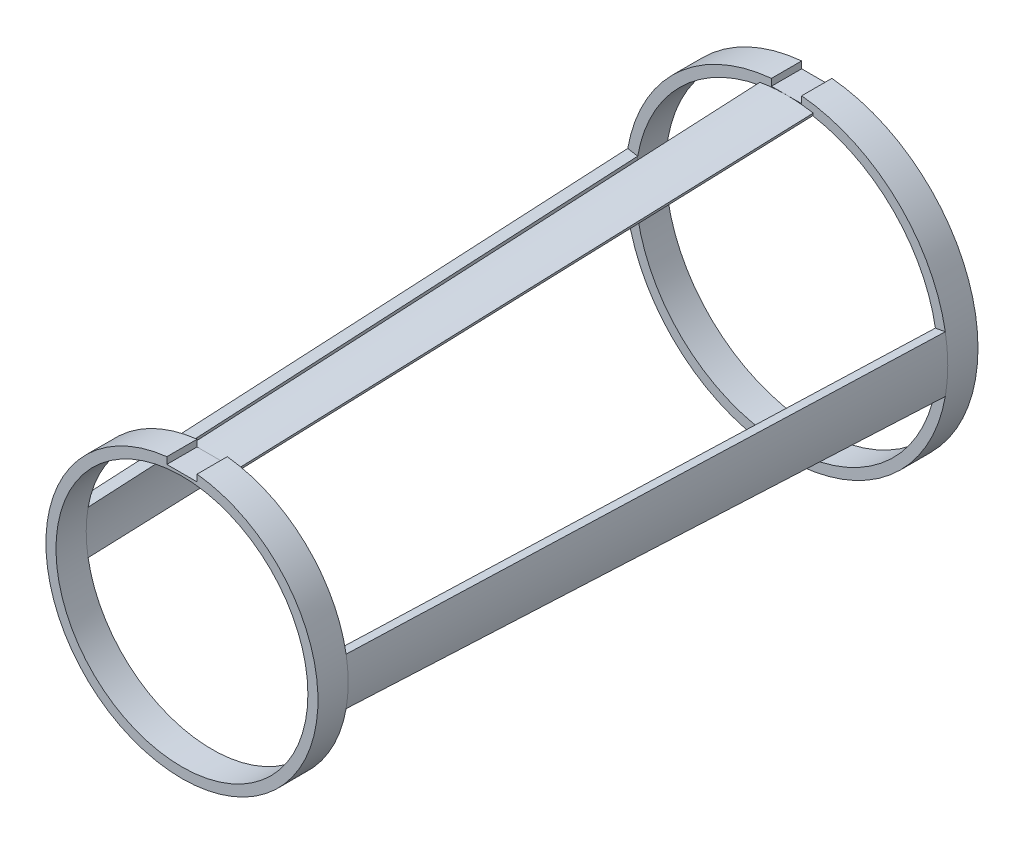
ISO-10303-21;
HEADER;
FILE_DESCRIPTION(('STEP AP214'),'2;1');
FILE_NAME('part.step','',(''),(''),'','','');
FILE_SCHEMA(('AUTOMOTIVE_DESIGN { 1 0 10303 214 1 1 1 1 }'));
ENDSEC;
DATA;
#1=APPLICATION_CONTEXT('core data for automotive mechanical design processes');
#2=APPLICATION_PROTOCOL_DEFINITION('international standard','automotive_design',2000,#1);
#3=PRODUCT_CONTEXT('',#1,'mechanical');
#4=PRODUCT('Part','Part','',(#3));
#5=PRODUCT_RELATED_PRODUCT_CATEGORY('part','',(#4));
#6=PRODUCT_DEFINITION_FORMATION('','',#4);
#7=PRODUCT_DEFINITION_CONTEXT('part definition',#1,'design');
#8=PRODUCT_DEFINITION('design','',#6,#7);
#9=PRODUCT_DEFINITION_SHAPE('','',#8);
#10=(LENGTH_UNIT() NAMED_UNIT(*) SI_UNIT(.MILLI.,.METRE.));
#11=(NAMED_UNIT(*) PLANE_ANGLE_UNIT() SI_UNIT($,.RADIAN.));
#12=(NAMED_UNIT(*) SI_UNIT($,.STERADIAN.) SOLID_ANGLE_UNIT());
#13=UNCERTAINTY_MEASURE_WITH_UNIT(LENGTH_MEASURE(1.E-05),#10,'distance_accuracy_value','');
#14=(GEOMETRIC_REPRESENTATION_CONTEXT(3) GLOBAL_UNCERTAINTY_ASSIGNED_CONTEXT((#13)) GLOBAL_UNIT_ASSIGNED_CONTEXT((#10,
#11,#12)) REPRESENTATION_CONTEXT('',''));
#15=CARTESIAN_POINT('',(0.,0.,0.));
#16=DIRECTION('',(0.,0.,1.));
#17=DIRECTION('',(1.,0.,0.));
#18=AXIS2_PLACEMENT_3D('',#15,#16,#17);
#19=CARTESIAN_POINT('',(0.,0.,3.81));
#20=DIRECTION('',(0.,0.,1.));
#21=DIRECTION('',(1.,0.,0.));
#22=AXIS2_PLACEMENT_3D('',#19,#20,#21);
#23=PLANE('',#22);
#24=CARTESIAN_POINT('',(0.,0.,3.81));
#25=DIRECTION('',(0.,0.,1.));
#26=DIRECTION('',(1.,0.,0.));
#27=AXIS2_PLACEMENT_3D('',#24,#25,#26);
#28=CIRCLE('',#27,38.1);
#29=CARTESIAN_POINT('',(-6.61599556911006,37.5211753897651,3.81));
#30=VERTEX_POINT('',#29);
#31=CARTESIAN_POINT('',(-37.5211753897651,6.61599556911006,3.81));
#32=VERTEX_POINT('',#31);
#33=EDGE_CURVE('E230',#30,#32,#28,.T.);
#34=ORIENTED_EDGE('',*,*,#33,.F.);
#35=DIRECTION('',(-0.173648177666931,0.984807753012208,0.));
#36=VECTOR('',#35,1.);
#37=CARTESIAN_POINT('',(-6.72626216192856,38.1465283129279,3.81));
#38=LINE('',#37,#36);
#39=CARTESIAN_POINT('',(-6.72626216192856,38.1465283129279,3.81));
#40=VERTEX_POINT('',#39);
#41=EDGE_CURVE('E57',#30,#40,#38,.T.);
#42=ORIENTED_EDGE('',*,*,#41,.T.);
#43=CARTESIAN_POINT('',(0.,0.,3.81));
#44=DIRECTION('',(0.,0.,-1.));
#45=DIRECTION('',(0.,1.,0.));
#46=AXIS2_PLACEMENT_3D('',#43,#44,#45);
#47=CIRCLE('',#46,38.735);
#48=CARTESIAN_POINT('',(-1.70648220900196E-11,38.735,3.81));
#49=VERTEX_POINT('',#48);
#50=EDGE_CURVE('E199',#40,#49,#47,.T.);
#51=ORIENTED_EDGE('',*,*,#50,.T.);
#52=DIRECTION('',(1.,0.,0.));
#53=VECTOR('',#52,1.);
#54=CARTESIAN_POINT('',(-3.81,38.735,3.81));
#55=LINE('',#54,#53);
#56=CARTESIAN_POINT('',(-3.81,38.735,3.81));
#57=VERTEX_POINT('',#56);
#58=EDGE_CURVE('E239',#57,#49,#55,.T.);
#59=ORIENTED_EDGE('',*,*,#58,.F.);
#60=DIRECTION('',(0.,-1.,0.));
#61=VECTOR('',#60,1.);
#62=CARTESIAN_POINT('',(-3.81,38.735,3.81));
#63=LINE('',#62,#61);
#64=CARTESIAN_POINT('',(-3.81,40.4610120980679,3.81));
#65=VERTEX_POINT('',#64);
#66=EDGE_CURVE('E265',#65,#57,#63,.T.);
#67=ORIENTED_EDGE('',*,*,#66,.F.);
#68=CARTESIAN_POINT('',(0.,0.,3.81));
#69=DIRECTION('',(0.,0.,1.));
#70=DIRECTION('',(1.,0.,0.));
#71=AXIS2_PLACEMENT_3D('',#68,#69,#70);
#72=CIRCLE('',#71,40.64);
#73=CARTESIAN_POINT('',(-40.0225870824161,7.05706194038406,3.81));
#74=VERTEX_POINT('',#73);
#75=EDGE_CURVE('E11',#65,#74,#72,.T.);
#76=ORIENTED_EDGE('',*,*,#75,.T.);
#77=DIRECTION('',(-0.984807753012208,0.173648177666931,0.));
#78=VECTOR('',#77,1.);
#79=CARTESIAN_POINT('',(-40.0225870824161,7.05706194038406,3.81));
#80=LINE('',#79,#78);
#81=EDGE_CURVE('E324',#32,#74,#80,.T.);
#82=ORIENTED_EDGE('',*,*,#81,.F.);
#83=EDGE_LOOP('',(#34,#42,#51,#59,#67,#76,#82));
#84=FACE_BOUND('',#83,.T.);
#85=ADVANCED_FACE('F39',(#84),#23,.T.);
#86=CARTESIAN_POINT('',(0.,0.,148.59));
#87=DIRECTION('',(0.,0.,1.));
#88=DIRECTION('',(1.,0.,0.));
#89=AXIS2_PLACEMENT_3D('',#86,#87,#88);
#90=PLANE('',#89);
#91=DIRECTION('',(0.173648177666931,-0.984807753012208,0.));
#92=VECTOR('',#91,1.);
#93=CARTESIAN_POINT('',(-5.62359623374355,31.8929990813004,148.59));
#94=LINE('',#93,#92);
#95=CARTESIAN_POINT('',(-5.62359623374355,31.8929990813004,148.59));
#96=VERTEX_POINT('',#95);
#97=CARTESIAN_POINT('',(-5.51332964092505,31.2676461581376,148.59));
#98=VERTEX_POINT('',#97);
#99=EDGE_CURVE('E442',#96,#98,#94,.T.);
#100=ORIENTED_EDGE('',*,*,#99,.T.);
#101=CARTESIAN_POINT('',(0.,0.,148.59));
#102=DIRECTION('',(0.,0.,1.));
#103=DIRECTION('',(1.,0.,0.));
#104=AXIS2_PLACEMENT_3D('',#101,#102,#103);
#105=CIRCLE('',#104,31.75);
#106=CARTESIAN_POINT('',(-31.2676461581376,5.51332964092505,148.59));
#107=VERTEX_POINT('',#106);
#108=EDGE_CURVE('E344',#98,#107,#105,.T.);
#109=ORIENTED_EDGE('',*,*,#108,.T.);
#110=DIRECTION('',(0.984807753012208,-0.173648177666931,0.));
#111=VECTOR('',#110,1.);
#112=CARTESIAN_POINT('',(-33.7690578507886,5.95439601219906,148.59));
#113=LINE('',#112,#111);
#114=CARTESIAN_POINT('',(-33.7690578507886,5.95439601219906,148.59));
#115=VERTEX_POINT('',#114);
#116=EDGE_CURVE('E316',#115,#107,#113,.T.);
#117=ORIENTED_EDGE('',*,*,#116,.F.);
#118=CARTESIAN_POINT('',(0.,0.,148.59));
#119=DIRECTION('',(0.,0.,1.));
#120=DIRECTION('',(1.,0.,0.));
#121=AXIS2_PLACEMENT_3D('',#118,#119,#120);
#122=CIRCLE('',#121,34.29);
#123=CARTESIAN_POINT('',(-3.81,34.0776759770968,148.59));
#124=VERTEX_POINT('',#123);
#125=EDGE_CURVE('E334',#124,#115,#122,.T.);
#126=ORIENTED_EDGE('',*,*,#125,.F.);
#127=DIRECTION('',(0.,1.,0.));
#128=VECTOR('',#127,1.);
#129=CARTESIAN_POINT('',(-3.81,32.385,148.59));
#130=LINE('',#129,#128);
#131=CARTESIAN_POINT('',(-3.81,32.385,148.59));
#132=VERTEX_POINT('',#131);
#133=EDGE_CURVE('E392',#132,#124,#130,.T.);
#134=ORIENTED_EDGE('',*,*,#133,.F.);
#135=DIRECTION('',(-1.,0.,0.));
#136=VECTOR('',#135,1.);
#137=CARTESIAN_POINT('',(-3.81,32.385,148.59));
#138=LINE('',#137,#136);
#139=CARTESIAN_POINT('',(-1.0468622496651E-11,32.385,148.59));
#140=VERTEX_POINT('',#139);
#141=EDGE_CURVE('E419',#140,#132,#138,.T.);
#142=ORIENTED_EDGE('',*,*,#141,.F.);
#143=CARTESIAN_POINT('',(0.,0.,148.59));
#144=DIRECTION('',(0.,0.,-1.));
#145=DIRECTION('',(0.,1.,0.));
#146=AXIS2_PLACEMENT_3D('',#143,#144,#145);
#147=CIRCLE('',#146,32.385);
#148=EDGE_CURVE('E65',#96,#140,#147,.T.);
#149=ORIENTED_EDGE('',*,*,#148,.F.);
#150=EDGE_LOOP('',(#100,#109,#117,#126,#134,#142,#149));
#151=FACE_BOUND('',#150,.T.);
#152=ADVANCED_FACE('F487',(#151),#90,.F.);
#153=CARTESIAN_POINT('',(-40.0225870824161,-7.05706194038406,3.81));
#154=VERTEX_POINT('',#153);
#155=CARTESIAN_POINT('',(40.0225870824161,-7.05706194038406,3.81));
#156=VERTEX_POINT('',#155);
#157=EDGE_CURVE('E49',#154,#156,#72,.T.);
#158=ORIENTED_EDGE('',*,*,#157,.T.);
#159=DIRECTION('',(-0.984807753012208,0.173648177666931,0.));
#160=VECTOR('',#159,1.);
#161=CARTESIAN_POINT('',(40.0225870824161,-7.05706194038406,3.81));
#162=LINE('',#161,#160);
#163=CARTESIAN_POINT('',(37.5211753897651,-6.61599556911006,3.81));
#164=VERTEX_POINT('',#163);
#165=EDGE_CURVE('E388',#156,#164,#162,.T.);
#166=ORIENTED_EDGE('',*,*,#165,.T.);
#167=CARTESIAN_POINT('',(-37.5211753897651,-6.61599556911006,3.81));
#168=VERTEX_POINT('',#167);
#169=EDGE_CURVE('E229',#168,#164,#28,.T.);
#170=ORIENTED_EDGE('',*,*,#169,.F.);
#171=DIRECTION('',(-0.984807753012208,-0.173648177666931,0.));
#172=VECTOR('',#171,1.);
#173=CARTESIAN_POINT('',(-40.0225870824161,-7.05706194038406,3.81));
#174=LINE('',#173,#172);
#175=EDGE_CURVE('E309',#168,#154,#174,.T.);
#176=ORIENTED_EDGE('',*,*,#175,.T.);
#177=EDGE_LOOP('',(#158,#166,#170,#176));
#178=FACE_BOUND('',#177,.T.);
#179=ADVANCED_FACE('F509',(#178),#23,.T.);
#180=DIRECTION('',(0.984807753012208,-0.173648177666931,0.));
#181=VECTOR('',#180,1.);
#182=CARTESIAN_POINT('',(33.7690578507886,-5.95439601219906,148.59));
#183=LINE('',#182,#181);
#184=CARTESIAN_POINT('',(31.2676461581376,-5.51332964092505,148.59));
#185=VERTEX_POINT('',#184);
#186=CARTESIAN_POINT('',(33.7690578507886,-5.95439601219906,148.59));
#187=VERTEX_POINT('',#186);
#188=EDGE_CURVE('E381',#185,#187,#183,.T.);
#189=ORIENTED_EDGE('',*,*,#188,.T.);
#190=CARTESIAN_POINT('',(-33.7690578507886,-5.95439601219905,148.59));
#191=VERTEX_POINT('',#190);
#192=EDGE_CURVE('E329',#191,#187,#122,.T.);
#193=ORIENTED_EDGE('',*,*,#192,.F.);
#194=DIRECTION('',(0.984807753012208,0.173648177666931,0.));
#195=VECTOR('',#194,1.);
#196=CARTESIAN_POINT('',(-33.7690578507886,-5.95439601219905,148.59));
#197=LINE('',#196,#195);
#198=CARTESIAN_POINT('',(-31.2676461581376,-5.51332964092505,148.59));
#199=VERTEX_POINT('',#198);
#200=EDGE_CURVE('E302',#191,#199,#197,.T.);
#201=ORIENTED_EDGE('',*,*,#200,.T.);
#202=EDGE_CURVE('E338',#199,#185,#105,.T.);
#203=ORIENTED_EDGE('',*,*,#202,.T.);
#204=EDGE_LOOP('',(#189,#193,#201,#203));
#205=FACE_BOUND('',#204,.T.);
#206=ADVANCED_FACE('F557',(#205),#90,.F.);
#207=CARTESIAN_POINT('',(6.72626216192856,38.1465283129279,3.81));
#208=VERTEX_POINT('',#207);
#209=EDGE_CURVE('E219',#49,#208,#47,.T.);
#210=ORIENTED_EDGE('',*,*,#209,.T.);
#211=DIRECTION('',(0.173648177666931,0.984807753012208,0.));
#212=VECTOR('',#211,1.);
#213=CARTESIAN_POINT('',(6.72626216192856,38.1465283129279,3.81));
#214=LINE('',#213,#212);
#215=CARTESIAN_POINT('',(6.61599556911006,37.5211753897651,3.81));
#216=VERTEX_POINT('',#215);
#217=EDGE_CURVE('E206',#216,#208,#214,.T.);
#218=ORIENTED_EDGE('',*,*,#217,.F.);
#219=CARTESIAN_POINT('',(37.5211753897651,6.61599556911006,3.81));
#220=VERTEX_POINT('',#219);
#221=EDGE_CURVE('E216',#220,#216,#28,.T.);
#222=ORIENTED_EDGE('',*,*,#221,.F.);
#223=DIRECTION('',(-0.984807753012208,-0.173648177666931,0.));
#224=VECTOR('',#223,1.);
#225=CARTESIAN_POINT('',(40.0225870824161,7.05706194038406,3.81));
#226=LINE('',#225,#224);
#227=CARTESIAN_POINT('',(40.0225870824161,7.05706194038406,3.81));
#228=VERTEX_POINT('',#227);
#229=EDGE_CURVE('E373',#228,#220,#226,.T.);
#230=ORIENTED_EDGE('',*,*,#229,.F.);
#231=CARTESIAN_POINT('',(3.81,40.4610120980679,3.81));
#232=VERTEX_POINT('',#231);
#233=EDGE_CURVE('E50',#228,#232,#72,.T.);
#234=ORIENTED_EDGE('',*,*,#233,.T.);
#235=DIRECTION('',(0.,1.,0.));
#236=VECTOR('',#235,1.);
#237=CARTESIAN_POINT('',(3.81,38.735,3.81));
#238=LINE('',#237,#236);
#239=CARTESIAN_POINT('',(3.81,38.735,3.81));
#240=VERTEX_POINT('',#239);
#241=EDGE_CURVE('E259',#240,#232,#238,.T.);
#242=ORIENTED_EDGE('',*,*,#241,.F.);
#243=EDGE_CURVE('E247',#49,#240,#55,.T.);
#244=ORIENTED_EDGE('',*,*,#243,.F.);
#245=EDGE_LOOP('',(#210,#218,#222,#230,#234,#242,#244));
#246=FACE_BOUND('',#245,.T.);
#247=ADVANCED_FACE('F214',(#246),#23,.T.);
#248=CARTESIAN_POINT('',(0.,0.,-3.81));
#249=DIRECTION('',(0.,0.,1.));
#250=DIRECTION('',(1.,0.,0.));
#251=AXIS2_PLACEMENT_3D('',#248,#249,#250);
#252=PLANE('',#251);
#253=CARTESIAN_POINT('',(0.,0.,-3.81));
#254=DIRECTION('',(0.,0.,1.));
#255=DIRECTION('',(1.,0.,0.));
#256=AXIS2_PLACEMENT_3D('',#253,#254,#255);
#257=CIRCLE('',#256,38.1);
#258=CARTESIAN_POINT('',(38.1,0.,-3.81));
#259=VERTEX_POINT('',#258);
#260=EDGE_CURVE('E235',#259,#259,#257,.T.);
#261=ORIENTED_EDGE('',*,*,#260,.T.);
#262=EDGE_LOOP('',(#261));
#263=FACE_BOUND('',#262,.T.);
#264=DIRECTION('',(0.,-1.,0.));
#265=VECTOR('',#264,1.);
#266=CARTESIAN_POINT('',(3.81,38.735,-3.81));
#267=LINE('',#266,#265);
#268=CARTESIAN_POINT('',(3.81,40.4610120980679,-3.81));
#269=VERTEX_POINT('',#268);
#270=CARTESIAN_POINT('',(3.81,38.735,-3.81));
#271=VERTEX_POINT('',#270);
#272=EDGE_CURVE('E279',#269,#271,#267,.T.);
#273=ORIENTED_EDGE('',*,*,#272,.F.);
#274=CARTESIAN_POINT('',(0.,0.,-3.81));
#275=DIRECTION('',(0.,0.,1.));
#276=DIRECTION('',(1.,0.,0.));
#277=AXIS2_PLACEMENT_3D('',#274,#275,#276);
#278=CIRCLE('',#277,40.64);
#279=CARTESIAN_POINT('',(-3.81,40.4610120980679,-3.81));
#280=VERTEX_POINT('',#279);
#281=EDGE_CURVE('E43',#280,#269,#278,.T.);
#282=ORIENTED_EDGE('',*,*,#281,.F.);
#283=DIRECTION('',(0.,1.,0.));
#284=VECTOR('',#283,1.);
#285=CARTESIAN_POINT('',(-3.81,38.735,-3.81));
#286=LINE('',#285,#284);
#287=CARTESIAN_POINT('',(-3.81,38.735,-3.81));
#288=VERTEX_POINT('',#287);
#289=EDGE_CURVE('E276',#288,#280,#286,.T.);
#290=ORIENTED_EDGE('',*,*,#289,.F.);
#291=DIRECTION('',(-1.,0.,0.));
#292=VECTOR('',#291,1.);
#293=CARTESIAN_POINT('',(-3.81,38.735,-3.81));
#294=LINE('',#293,#292);
#295=EDGE_CURVE('E283',#271,#288,#294,.T.);
#296=ORIENTED_EDGE('',*,*,#295,.F.);
#297=EDGE_LOOP('',(#273,#282,#290,#296));
#298=FACE_BOUND('',#297,.T.);
#299=ADVANCED_FACE('F530',(#263,#298),#252,.F.);
#300=CARTESIAN_POINT('',(0.,0.,3.81));
#301=DIRECTION('',(0.,0.,-1.));
#302=DIRECTION('',(-1.,0.,0.));
#303=AXIS2_PLACEMENT_3D('',#300,#301,#302);
#304=CYLINDRICAL_SURFACE('',#303,40.64);
#305=DIRECTION('',(0.,0.,-1.));
#306=VECTOR('',#305,1.);
#307=CARTESIAN_POINT('',(3.81,40.4610120980679,3.81));
#308=LINE('',#307,#306);
#309=EDGE_CURVE('E268',#269,#232,#308,.F.);
#310=ORIENTED_EDGE('',*,*,#309,.T.);
#311=ORIENTED_EDGE('',*,*,#233,.F.);
#312=CARTESIAN_POINT('',(0.,0.,3.81));
#313=DIRECTION('',(0.,0.,-1.));
#314=DIRECTION('',(-1.,0.,0.));
#315=AXIS2_PLACEMENT_3D('',#312,#313,#314);
#316=CIRCLE('',#315,40.64);
#317=EDGE_CURVE('E357',#228,#156,#316,.T.);
#318=ORIENTED_EDGE('',*,*,#317,.T.);
#319=ORIENTED_EDGE('',*,*,#157,.F.);
#320=CARTESIAN_POINT('',(0.,0.,3.81));
#321=DIRECTION('',(0.,0.,-1.));
#322=DIRECTION('',(-1.,0.,0.));
#323=AXIS2_PLACEMENT_3D('',#320,#321,#322);
#324=CIRCLE('',#323,40.64);
#325=EDGE_CURVE('E294',#154,#74,#324,.T.);
#326=ORIENTED_EDGE('',*,*,#325,.T.);
#327=ORIENTED_EDGE('',*,*,#75,.F.);
#328=DIRECTION('',(0.,0.,-1.));
#329=VECTOR('',#328,1.);
#330=CARTESIAN_POINT('',(-3.81,40.4610120980679,3.81));
#331=LINE('',#330,#329);
#332=EDGE_CURVE('E272',#65,#280,#331,.T.);
#333=ORIENTED_EDGE('',*,*,#332,.T.);
#334=ORIENTED_EDGE('',*,*,#281,.T.);
#335=EDGE_LOOP('',(#310,#311,#318,#319,#326,#327,#333,#334));
#336=FACE_BOUND('',#335,.T.);
#337=ADVANCED_FACE('F41',(#336),#304,.T.);
#338=CARTESIAN_POINT('',(0.,0.,3.81));
#339=DIRECTION('',(0.,0.,-1.));
#340=DIRECTION('',(-1.,0.,0.));
#341=AXIS2_PLACEMENT_3D('',#338,#339,#340);
#342=CYLINDRICAL_SURFACE('',#341,38.1);
#343=EDGE_CURVE('E234',#32,#168,#28,.T.);
#344=ORIENTED_EDGE('',*,*,#343,.T.);
#345=ORIENTED_EDGE('',*,*,#169,.T.);
#346=CARTESIAN_POINT('',(0.,0.,3.81));
#347=DIRECTION('',(0.,0.,-1.));
#348=DIRECTION('',(-1.,0.,0.));
#349=AXIS2_PLACEMENT_3D('',#346,#347,#348);
#350=CIRCLE('',#349,38.1);
#351=EDGE_CURVE('E227',#220,#164,#350,.T.);
#352=ORIENTED_EDGE('',*,*,#351,.F.);
#353=ORIENTED_EDGE('',*,*,#221,.T.);
#354=CARTESIAN_POINT('',(0.,0.,3.81));
#355=DIRECTION('',(0.,0.,-1.));
#356=DIRECTION('',(0.,1.,0.));
#357=AXIS2_PLACEMENT_3D('',#354,#355,#356);
#358=CIRCLE('',#357,38.1);
#359=EDGE_CURVE('E188',#30,#216,#358,.T.);
#360=ORIENTED_EDGE('',*,*,#359,.F.);
#361=ORIENTED_EDGE('',*,*,#33,.T.);
#362=EDGE_LOOP('',(#344,#345,#352,#353,#360,#361));
#363=FACE_BOUND('',#362,.T.);
#364=ORIENTED_EDGE('',*,*,#260,.F.);
#365=EDGE_LOOP('',(#364));
#366=FACE_BOUND('',#365,.T.);
#367=ADVANCED_FACE('F224',(#363,#366),#342,.F.);
#368=CARTESIAN_POINT('',(3.81,38.735,3.811));
#369=DIRECTION('',(-1.,0.,0.));
#370=DIRECTION('',(0.,0.,1.));
#371=AXIS2_PLACEMENT_3D('',#368,#369,#370);
#372=PLANE('',#371);
#373=ORIENTED_EDGE('',*,*,#241,.T.);
#374=ORIENTED_EDGE('',*,*,#309,.F.);
#375=ORIENTED_EDGE('',*,*,#272,.T.);
#376=DIRECTION('',(0.,0.,-1.));
#377=VECTOR('',#376,1.);
#378=CARTESIAN_POINT('',(3.81,38.735,3.811));
#379=LINE('',#378,#377);
#380=EDGE_CURVE('E254',#240,#271,#379,.T.);
#381=ORIENTED_EDGE('',*,*,#380,.F.);
#382=EDGE_LOOP('',(#373,#374,#375,#381));
#383=FACE_BOUND('',#382,.T.);
#384=ADVANCED_FACE('F533',(#383),#372,.T.);
#385=CARTESIAN_POINT('',(-3.81,38.735,3.811));
#386=DIRECTION('',(1.,0.,0.));
#387=DIRECTION('',(0.,0.,-1.));
#388=AXIS2_PLACEMENT_3D('',#385,#386,#387);
#389=PLANE('',#388);
#390=ORIENTED_EDGE('',*,*,#66,.T.);
#391=DIRECTION('',(0.,0.,-1.));
#392=VECTOR('',#391,1.);
#393=CARTESIAN_POINT('',(-3.81,38.735,3.811));
#394=LINE('',#393,#392);
#395=EDGE_CURVE('E251',#57,#288,#394,.T.);
#396=ORIENTED_EDGE('',*,*,#395,.T.);
#397=ORIENTED_EDGE('',*,*,#289,.T.);
#398=ORIENTED_EDGE('',*,*,#332,.F.);
#399=EDGE_LOOP('',(#390,#396,#397,#398));
#400=FACE_BOUND('',#399,.T.);
#401=ADVANCED_FACE('F535',(#400),#389,.T.);
#402=CARTESIAN_POINT('',(-3.81,38.735,3.811));
#403=DIRECTION('',(0.,1.,0.));
#404=DIRECTION('',(0.,0.,1.));
#405=AXIS2_PLACEMENT_3D('',#402,#403,#404);
#406=PLANE('',#405);
#407=ORIENTED_EDGE('',*,*,#58,.T.);
#408=ORIENTED_EDGE('',*,*,#243,.T.);
#409=ORIENTED_EDGE('',*,*,#380,.T.);
#410=ORIENTED_EDGE('',*,*,#295,.T.);
#411=ORIENTED_EDGE('',*,*,#395,.F.);
#412=EDGE_LOOP('',(#407,#408,#409,#410,#411));
#413=FACE_BOUND('',#412,.T.);
#414=ADVANCED_FACE('F534',(#413),#406,.T.);
#415=CARTESIAN_POINT('',(0.,0.,148.59));
#416=DIRECTION('',(0.,0.,-1.));
#417=DIRECTION('',(-1.,0.,0.));
#418=AXIS2_PLACEMENT_3D('',#415,#416,#417);
#419=CONICAL_SURFACE('',#418,31.75,0.0438315577256377);
#420=CARTESIAN_POINT('',(0.,0.,148.59));
#421=DIRECTION('',(0.,0.,-1.));
#422=DIRECTION('',(-1.,0.,0.));
#423=AXIS2_PLACEMENT_3D('',#420,#421,#422);
#424=CIRCLE('',#423,31.75);
#425=EDGE_CURVE('E286',#199,#107,#424,.T.);
#426=ORIENTED_EDGE('',*,*,#425,.F.);
#427=DIRECTION('',(-0.0431518375195846,-0.00760883322185063,-0.999039551056757));
#428=VECTOR('',#427,1.);
#429=CARTESIAN_POINT('',(-37.5211753897651,-6.61599556911006,3.81));
#430=LINE('',#429,#428);
#431=EDGE_CURVE('E298',#199,#168,#430,.T.);
#432=ORIENTED_EDGE('',*,*,#431,.T.);
#433=ORIENTED_EDGE('',*,*,#343,.F.);
#434=DIRECTION('',(-0.0431518375195846,0.00760883322185063,-0.999039551056757));
#435=VECTOR('',#434,1.);
#436=CARTESIAN_POINT('',(-37.5211753897651,6.61599556911006,3.81));
#437=LINE('',#436,#435);
#438=EDGE_CURVE('E312',#107,#32,#437,.T.);
#439=ORIENTED_EDGE('',*,*,#438,.F.);
#440=EDGE_LOOP('',(#426,#432,#433,#439));
#441=FACE_BOUND('',#440,.T.);
#442=ADVANCED_FACE('F504',(#441),#419,.F.);
#443=CARTESIAN_POINT('',(0.,0.,3.81));
#444=DIRECTION('',(0.,0.,-1.));
#445=DIRECTION('',(-1.,0.,0.));
#446=AXIS2_PLACEMENT_3D('',#443,#444,#445);
#447=CONICAL_SURFACE('',#446,40.64,0.0438315577256377);
#448=DIRECTION('',(0.0431518375195846,0.00760883322185063,0.999039551056757));
#449=VECTOR('',#448,1.);
#450=CARTESIAN_POINT('',(-40.0225870824161,-7.05706194038406,3.81));
#451=LINE('',#450,#449);
#452=EDGE_CURVE('E305',#154,#191,#451,.T.);
#453=ORIENTED_EDGE('',*,*,#452,.T.);
#454=CARTESIAN_POINT('',(0.,0.,148.59));
#455=DIRECTION('',(0.,0.,-1.));
#456=DIRECTION('',(-1.,0.,0.));
#457=AXIS2_PLACEMENT_3D('',#454,#455,#456);
#458=CIRCLE('',#457,34.29);
#459=EDGE_CURVE('E290',#191,#115,#458,.T.);
#460=ORIENTED_EDGE('',*,*,#459,.T.);
#461=DIRECTION('',(0.0431518375195846,-0.00760883322185063,0.999039551056757));
#462=VECTOR('',#461,1.);
#463=CARTESIAN_POINT('',(-40.0225870824161,7.05706194038406,3.81));
#464=LINE('',#463,#462);
#465=EDGE_CURVE('E320',#74,#115,#464,.T.);
#466=ORIENTED_EDGE('',*,*,#465,.F.);
#467=ORIENTED_EDGE('',*,*,#325,.F.);
#468=EDGE_LOOP('',(#453,#460,#466,#467));
#469=FACE_BOUND('',#468,.T.);
#470=ADVANCED_FACE('F492',(#469),#447,.T.);
#471=CARTESIAN_POINT('',(0.,0.,0.));
#472=DIRECTION('',(0.173648177666931,-0.984807753012208,0.));
#473=DIRECTION('',(0.,0.,-1.));
#474=AXIS2_PLACEMENT_3D('',#471,#472,#473);
#475=PLANE('',#474);
#476=ORIENTED_EDGE('',*,*,#175,.F.);
#477=ORIENTED_EDGE('',*,*,#431,.F.);
#478=ORIENTED_EDGE('',*,*,#200,.F.);
#479=ORIENTED_EDGE('',*,*,#452,.F.);
#480=EDGE_LOOP('',(#476,#477,#478,#479));
#481=FACE_BOUND('',#480,.T.);
#482=ADVANCED_FACE('F575',(#481),#475,.T.);
#483=CARTESIAN_POINT('',(0.,0.,0.));
#484=DIRECTION('',(-0.173648177666931,-0.984807753012208,0.));
#485=DIRECTION('',(0.,0.,-1.));
#486=AXIS2_PLACEMENT_3D('',#483,#484,#485);
#487=PLANE('',#486);
#488=ORIENTED_EDGE('',*,*,#81,.T.);
#489=ORIENTED_EDGE('',*,*,#465,.T.);
#490=ORIENTED_EDGE('',*,*,#116,.T.);
#491=ORIENTED_EDGE('',*,*,#438,.T.);
#492=EDGE_LOOP('',(#488,#489,#490,#491));
#493=FACE_BOUND('',#492,.T.);
#494=ADVANCED_FACE('F496',(#493),#487,.F.);
#495=DIRECTION('',(-0.173648177666931,-0.984807753012208,0.));
#496=VECTOR('',#495,1.);
#497=CARTESIAN_POINT('',(5.62359623374355,31.8929990813004,148.59));
#498=LINE('',#497,#496);
#499=CARTESIAN_POINT('',(5.62359623374355,31.8929990813004,148.59));
#500=VERTEX_POINT('',#499);
#501=CARTESIAN_POINT('',(5.51332964092505,31.2676461581376,148.59));
#502=VERTEX_POINT('',#501);
#503=EDGE_CURVE('E208',#500,#502,#498,.T.);
#504=ORIENTED_EDGE('',*,*,#503,.F.);
#505=EDGE_CURVE('E433',#140,#500,#147,.T.);
#506=ORIENTED_EDGE('',*,*,#505,.F.);
#507=CARTESIAN_POINT('',(3.81,32.385,148.59));
#508=VERTEX_POINT('',#507);
#509=EDGE_CURVE('E415',#508,#140,#138,.T.);
#510=ORIENTED_EDGE('',*,*,#509,.F.);
#511=DIRECTION('',(0.,-1.,0.));
#512=VECTOR('',#511,1.);
#513=CARTESIAN_POINT('',(3.81,32.385,148.59));
#514=LINE('',#513,#512);
#515=CARTESIAN_POINT('',(3.81,34.0776759770968,148.59));
#516=VERTEX_POINT('',#515);
#517=EDGE_CURVE('E412',#516,#508,#514,.T.);
#518=ORIENTED_EDGE('',*,*,#517,.F.);
#519=CARTESIAN_POINT('',(33.7690578507886,5.95439601219905,148.59));
#520=VERTEX_POINT('',#519);
#521=EDGE_CURVE('E333',#520,#516,#122,.T.);
#522=ORIENTED_EDGE('',*,*,#521,.F.);
#523=DIRECTION('',(0.984807753012208,0.173648177666931,0.));
#524=VECTOR('',#523,1.);
#525=CARTESIAN_POINT('',(33.7690578507886,5.95439601219905,148.59));
#526=LINE('',#525,#524);
#527=CARTESIAN_POINT('',(31.2676461581376,5.51332964092505,148.59));
#528=VERTEX_POINT('',#527);
#529=EDGE_CURVE('E365',#528,#520,#526,.T.);
#530=ORIENTED_EDGE('',*,*,#529,.F.);
#531=EDGE_CURVE('E343',#528,#502,#105,.T.);
#532=ORIENTED_EDGE('',*,*,#531,.T.);
#533=EDGE_LOOP('',(#504,#506,#510,#518,#522,#530,#532));
#534=FACE_BOUND('',#533,.T.);
#535=ADVANCED_FACE('F466',(#534),#90,.F.);
#536=CARTESIAN_POINT('',(0.,0.,156.21));
#537=DIRECTION('',(0.,0.,1.));
#538=DIRECTION('',(1.,0.,0.));
#539=AXIS2_PLACEMENT_3D('',#536,#537,#538);
#540=PLANE('',#539);
#541=DIRECTION('',(0.,1.,0.));
#542=VECTOR('',#541,1.);
#543=CARTESIAN_POINT('',(3.81,32.385,156.21));
#544=LINE('',#543,#542);
#545=CARTESIAN_POINT('',(3.81,32.385,156.21));
#546=VERTEX_POINT('',#545);
#547=CARTESIAN_POINT('',(3.81,34.0776759770968,156.21));
#548=VERTEX_POINT('',#547);
#549=EDGE_CURVE('E409',#546,#548,#544,.T.);
#550=ORIENTED_EDGE('',*,*,#549,.F.);
#551=DIRECTION('',(1.,0.,0.));
#552=VECTOR('',#551,1.);
#553=CARTESIAN_POINT('',(-3.81,32.385,156.21));
#554=LINE('',#553,#552);
#555=CARTESIAN_POINT('',(-3.81,32.385,156.21));
#556=VERTEX_POINT('',#555);
#557=EDGE_CURVE('E399',#556,#546,#554,.T.);
#558=ORIENTED_EDGE('',*,*,#557,.F.);
#559=DIRECTION('',(0.,-1.,0.));
#560=VECTOR('',#559,1.);
#561=CARTESIAN_POINT('',(-3.81,32.385,156.21));
#562=LINE('',#561,#560);
#563=CARTESIAN_POINT('',(-3.81,34.0776759770968,156.21));
#564=VERTEX_POINT('',#563);
#565=EDGE_CURVE('E405',#564,#556,#562,.T.);
#566=ORIENTED_EDGE('',*,*,#565,.F.);
#567=CARTESIAN_POINT('',(0.,0.,156.21));
#568=DIRECTION('',(0.,0.,1.));
#569=DIRECTION('',(1.,0.,0.));
#570=AXIS2_PLACEMENT_3D('',#567,#568,#569);
#571=CIRCLE('',#570,34.29);
#572=EDGE_CURVE('E328',#564,#548,#571,.T.);
#573=ORIENTED_EDGE('',*,*,#572,.T.);
#574=EDGE_LOOP('',(#550,#558,#566,#573));
#575=FACE_BOUND('',#574,.T.);
#576=CARTESIAN_POINT('',(0.,0.,156.21));
#577=DIRECTION('',(0.,0.,1.));
#578=DIRECTION('',(1.,0.,0.));
#579=AXIS2_PLACEMENT_3D('',#576,#577,#578);
#580=CIRCLE('',#579,31.75);
#581=CARTESIAN_POINT('',(31.75,0.,156.21));
#582=VERTEX_POINT('',#581);
#583=EDGE_CURVE('E342',#582,#582,#580,.T.);
#584=ORIENTED_EDGE('',*,*,#583,.F.);
#585=EDGE_LOOP('',(#584));
#586=FACE_BOUND('',#585,.T.);
#587=ADVANCED_FACE('F479',(#575,#586),#540,.T.);
#588=CARTESIAN_POINT('',(0.,0.,156.21));
#589=DIRECTION('',(0.,0.,-1.));
#590=DIRECTION('',(-1.,0.,0.));
#591=AXIS2_PLACEMENT_3D('',#588,#589,#590);
#592=CYLINDRICAL_SURFACE('',#591,34.29);
#593=ORIENTED_EDGE('',*,*,#521,.T.);
#594=DIRECTION('',(0.,0.,-1.));
#595=VECTOR('',#594,1.);
#596=CARTESIAN_POINT('',(3.81,34.0776759770968,156.21));
#597=LINE('',#596,#595);
#598=EDGE_CURVE('E420',#548,#516,#597,.T.);
#599=ORIENTED_EDGE('',*,*,#598,.F.);
#600=ORIENTED_EDGE('',*,*,#572,.F.);
#601=DIRECTION('',(0.,0.,-1.));
#602=VECTOR('',#601,1.);
#603=CARTESIAN_POINT('',(-3.81,34.0776759770968,156.21));
#604=LINE('',#603,#602);
#605=EDGE_CURVE('E423',#124,#564,#604,.F.);
#606=ORIENTED_EDGE('',*,*,#605,.F.);
#607=ORIENTED_EDGE('',*,*,#125,.T.);
#608=ORIENTED_EDGE('',*,*,#459,.F.);
#609=ORIENTED_EDGE('',*,*,#192,.T.);
#610=CARTESIAN_POINT('',(0.,0.,148.59));
#611=DIRECTION('',(0.,0.,-1.));
#612=DIRECTION('',(-1.,0.,0.));
#613=AXIS2_PLACEMENT_3D('',#610,#611,#612);
#614=CIRCLE('',#613,34.29);
#615=EDGE_CURVE('E353',#520,#187,#614,.T.);
#616=ORIENTED_EDGE('',*,*,#615,.F.);
#617=EDGE_LOOP('',(#593,#599,#600,#606,#607,#608,#609,#616));
#618=FACE_BOUND('',#617,.T.);
#619=ADVANCED_FACE('F461',(#618),#592,.T.);
#620=CARTESIAN_POINT('',(0.,0.,156.21));
#621=DIRECTION('',(0.,0.,-1.));
#622=DIRECTION('',(-1.,0.,0.));
#623=AXIS2_PLACEMENT_3D('',#620,#621,#622);
#624=CYLINDRICAL_SURFACE('',#623,31.75);
#625=ORIENTED_EDGE('',*,*,#583,.T.);
#626=EDGE_LOOP('',(#625));
#627=FACE_BOUND('',#626,.T.);
#628=ORIENTED_EDGE('',*,*,#425,.T.);
#629=ORIENTED_EDGE('',*,*,#108,.F.);
#630=CARTESIAN_POINT('',(0.,0.,148.59));
#631=DIRECTION('',(0.,0.,-1.));
#632=DIRECTION('',(0.,1.,0.));
#633=AXIS2_PLACEMENT_3D('',#630,#631,#632);
#634=CIRCLE('',#633,31.75);
#635=EDGE_CURVE('E198',#98,#502,#634,.T.);
#636=ORIENTED_EDGE('',*,*,#635,.T.);
#637=ORIENTED_EDGE('',*,*,#531,.F.);
#638=CARTESIAN_POINT('',(0.,0.,148.59));
#639=DIRECTION('',(0.,0.,-1.));
#640=DIRECTION('',(-1.,0.,0.));
#641=AXIS2_PLACEMENT_3D('',#638,#639,#640);
#642=CIRCLE('',#641,31.75);
#643=EDGE_CURVE('E350',#528,#185,#642,.T.);
#644=ORIENTED_EDGE('',*,*,#643,.T.);
#645=ORIENTED_EDGE('',*,*,#202,.F.);
#646=EDGE_LOOP('',(#628,#629,#636,#637,#644,#645));
#647=FACE_BOUND('',#646,.T.);
#648=ADVANCED_FACE('F540',(#627,#647),#624,.F.);
#649=CARTESIAN_POINT('',(0.,0.,3.81));
#650=DIRECTION('',(0.,0.,-1.));
#651=DIRECTION('',(-1.,0.,0.));
#652=AXIS2_PLACEMENT_3D('',#649,#650,#651);
#653=CONICAL_SURFACE('',#652,38.1,0.0438315577256377);
#654=ORIENTED_EDGE('',*,*,#643,.F.);
#655=DIRECTION('',(-0.0431518375195846,-0.00760883322185063,0.999039551056757));
#656=VECTOR('',#655,1.);
#657=CARTESIAN_POINT('',(37.5211753897651,6.61599556911006,3.81));
#658=LINE('',#657,#656);
#659=EDGE_CURVE('E369',#220,#528,#658,.T.);
#660=ORIENTED_EDGE('',*,*,#659,.F.);
#661=ORIENTED_EDGE('',*,*,#351,.T.);
#662=DIRECTION('',(-0.0431518375195846,0.00760883322185063,0.999039551056757));
#663=VECTOR('',#662,1.);
#664=CARTESIAN_POINT('',(37.5211753897651,-6.61599556911006,3.81));
#665=LINE('',#664,#663);
#666=EDGE_CURVE('E384',#164,#185,#665,.T.);
#667=ORIENTED_EDGE('',*,*,#666,.T.);
#668=EDGE_LOOP('',(#654,#660,#661,#667));
#669=FACE_BOUND('',#668,.T.);
#670=ADVANCED_FACE('F637',(#669),#653,.F.);
#671=CARTESIAN_POINT('',(0.,0.,148.59));
#672=DIRECTION('',(0.,0.,-1.));
#673=DIRECTION('',(-1.,0.,0.));
#674=AXIS2_PLACEMENT_3D('',#671,#672,#673);
#675=CONICAL_SURFACE('',#674,34.29,0.0438315577256377);
#676=DIRECTION('',(0.0431518375195846,0.00760883322185063,-0.999039551056757));
#677=VECTOR('',#676,1.);
#678=CARTESIAN_POINT('',(40.0225870824161,7.05706194038406,3.81));
#679=LINE('',#678,#677);
#680=EDGE_CURVE('E361',#520,#228,#679,.T.);
#681=ORIENTED_EDGE('',*,*,#680,.F.);
#682=ORIENTED_EDGE('',*,*,#615,.T.);
#683=DIRECTION('',(0.0431518375195846,-0.00760883322185063,-0.999039551056757));
#684=VECTOR('',#683,1.);
#685=CARTESIAN_POINT('',(40.0225870824161,-7.05706194038406,3.81));
#686=LINE('',#685,#684);
#687=EDGE_CURVE('E377',#187,#156,#686,.T.);
#688=ORIENTED_EDGE('',*,*,#687,.T.);
#689=ORIENTED_EDGE('',*,*,#317,.F.);
#690=EDGE_LOOP('',(#681,#682,#688,#689));
#691=FACE_BOUND('',#690,.T.);
#692=ADVANCED_FACE('F518',(#691),#675,.T.);
#693=CARTESIAN_POINT('',(0.,0.,0.));
#694=DIRECTION('',(-0.173648177666931,0.984807753012208,0.));
#695=DIRECTION('',(0.,0.,1.));
#696=AXIS2_PLACEMENT_3D('',#693,#694,#695);
#697=PLANE('',#696);
#698=ORIENTED_EDGE('',*,*,#229,.T.);
#699=ORIENTED_EDGE('',*,*,#659,.T.);
#700=ORIENTED_EDGE('',*,*,#529,.T.);
#701=ORIENTED_EDGE('',*,*,#680,.T.);
#702=EDGE_LOOP('',(#698,#699,#700,#701));
#703=FACE_BOUND('',#702,.T.);
#704=ADVANCED_FACE('F704',(#703),#697,.T.);
#705=CARTESIAN_POINT('',(0.,0.,0.));
#706=DIRECTION('',(0.173648177666931,0.984807753012208,0.));
#707=DIRECTION('',(0.,0.,1.));
#708=AXIS2_PLACEMENT_3D('',#705,#706,#707);
#709=PLANE('',#708);
#710=ORIENTED_EDGE('',*,*,#165,.F.);
#711=ORIENTED_EDGE('',*,*,#687,.F.);
#712=ORIENTED_EDGE('',*,*,#188,.F.);
#713=ORIENTED_EDGE('',*,*,#666,.F.);
#714=EDGE_LOOP('',(#710,#711,#712,#713));
#715=FACE_BOUND('',#714,.T.);
#716=ADVANCED_FACE('F514',(#715),#709,.F.);
#717=CARTESIAN_POINT('',(3.81,32.385,-3.81100000000001));
#718=DIRECTION('',(1.,0.,0.));
#719=DIRECTION('',(0.,0.,-1.));
#720=AXIS2_PLACEMENT_3D('',#717,#718,#719);
#721=PLANE('',#720);
#722=ORIENTED_EDGE('',*,*,#517,.T.);
#723=DIRECTION('',(0.,0.,1.));
#724=VECTOR('',#723,1.);
#725=CARTESIAN_POINT('',(3.81,32.385,-3.81100000000001));
#726=LINE('',#725,#724);
#727=EDGE_CURVE('E395',#508,#546,#726,.T.);
#728=ORIENTED_EDGE('',*,*,#727,.T.);
#729=ORIENTED_EDGE('',*,*,#549,.T.);
#730=ORIENTED_EDGE('',*,*,#598,.T.);
#731=EDGE_LOOP('',(#722,#728,#729,#730));
#732=FACE_BOUND('',#731,.T.);
#733=ADVANCED_FACE('F471',(#732),#721,.F.);
#734=CARTESIAN_POINT('',(-3.81,32.385,-3.81100000000001));
#735=DIRECTION('',(0.,-1.,0.));
#736=DIRECTION('',(0.,0.,-1.));
#737=AXIS2_PLACEMENT_3D('',#734,#735,#736);
#738=PLANE('',#737);
#739=ORIENTED_EDGE('',*,*,#509,.T.);
#740=ORIENTED_EDGE('',*,*,#141,.T.);
#741=DIRECTION('',(0.,0.,1.));
#742=VECTOR('',#741,1.);
#743=CARTESIAN_POINT('',(-3.81,32.385,-3.81100000000001));
#744=LINE('',#743,#742);
#745=EDGE_CURVE('E396',#132,#556,#744,.T.);
#746=ORIENTED_EDGE('',*,*,#745,.T.);
#747=ORIENTED_EDGE('',*,*,#557,.T.);
#748=ORIENTED_EDGE('',*,*,#727,.F.);
#749=EDGE_LOOP('',(#739,#740,#746,#747,#748));
#750=FACE_BOUND('',#749,.T.);
#751=ADVANCED_FACE('F473',(#750),#738,.F.);
#752=CARTESIAN_POINT('',(-3.81,32.385,-3.81100000000001));
#753=DIRECTION('',(-1.,0.,0.));
#754=DIRECTION('',(0.,0.,1.));
#755=AXIS2_PLACEMENT_3D('',#752,#753,#754);
#756=PLANE('',#755);
#757=ORIENTED_EDGE('',*,*,#133,.T.);
#758=ORIENTED_EDGE('',*,*,#605,.T.);
#759=ORIENTED_EDGE('',*,*,#565,.T.);
#760=ORIENTED_EDGE('',*,*,#745,.F.);
#761=EDGE_LOOP('',(#757,#758,#759,#760));
#762=FACE_BOUND('',#761,.T.);
#763=ADVANCED_FACE('F541',(#762),#756,.F.);
#764=CARTESIAN_POINT('',(0.,0.,148.59));
#765=DIRECTION('',(0.,0.,-1.));
#766=DIRECTION('',(0.,1.,0.));
#767=AXIS2_PLACEMENT_3D('',#764,#765,#766);
#768=CONICAL_SURFACE('',#767,31.75,0.0438315577256377);
#769=ORIENTED_EDGE('',*,*,#359,.T.);
#770=DIRECTION('',(0.00760883322185063,0.0431518375195846,-0.999039551056757));
#771=VECTOR('',#770,1.);
#772=CARTESIAN_POINT('',(5.51332964092505,31.2676461581376,148.59));
#773=LINE('',#772,#771);
#774=EDGE_CURVE('E192',#502,#216,#773,.T.);
#775=ORIENTED_EDGE('',*,*,#774,.F.);
#776=ORIENTED_EDGE('',*,*,#635,.F.);
#777=DIRECTION('',(-0.00760883322185063,0.0431518375195846,-0.999039551056757));
#778=VECTOR('',#777,1.);
#779=CARTESIAN_POINT('',(-5.51332964092505,31.2676461581376,148.59));
#780=LINE('',#779,#778);
#781=EDGE_CURVE('E193',#98,#30,#780,.T.);
#782=ORIENTED_EDGE('',*,*,#781,.T.);
#783=EDGE_LOOP('',(#769,#775,#776,#782));
#784=FACE_BOUND('',#783,.T.);
#785=ADVANCED_FACE('F190',(#784),#768,.F.);
#786=CARTESIAN_POINT('',(0.,0.,3.81));
#787=DIRECTION('',(0.,0.,-1.));
#788=DIRECTION('',(0.,1.,0.));
#789=AXIS2_PLACEMENT_3D('',#786,#787,#788);
#790=CONICAL_SURFACE('',#789,38.735,0.0438315577256377);
#791=DIRECTION('',(0.00760883322185063,-0.0431518375195846,0.999039551056757));
#792=VECTOR('',#791,1.);
#793=CARTESIAN_POINT('',(-5.62359623374355,31.8929990813004,148.59));
#794=LINE('',#793,#792);
#795=EDGE_CURVE('E434',#40,#96,#794,.T.);
#796=ORIENTED_EDGE('',*,*,#795,.T.);
#797=ORIENTED_EDGE('',*,*,#148,.T.);
#798=ORIENTED_EDGE('',*,*,#505,.T.);
#799=DIRECTION('',(-0.00760883322185063,-0.0431518375195846,0.999039551056757));
#800=VECTOR('',#799,1.);
#801=CARTESIAN_POINT('',(5.62359623374355,31.8929990813004,148.59));
#802=LINE('',#801,#800);
#803=EDGE_CURVE('E221',#208,#500,#802,.T.);
#804=ORIENTED_EDGE('',*,*,#803,.F.);
#805=ORIENTED_EDGE('',*,*,#209,.F.);
#806=ORIENTED_EDGE('',*,*,#50,.F.);
#807=EDGE_LOOP('',(#796,#797,#798,#804,#805,#806));
#808=FACE_BOUND('',#807,.T.);
#809=ADVANCED_FACE('F537',(#808),#790,.T.);
#810=CARTESIAN_POINT('',(0.,0.,0.));
#811=DIRECTION('',(0.984807753012208,0.173648177666931,0.));
#812=DIRECTION('',(0.,0.,-1.));
#813=AXIS2_PLACEMENT_3D('',#810,#811,#812);
#814=PLANE('',#813);
#815=ORIENTED_EDGE('',*,*,#99,.F.);
#816=ORIENTED_EDGE('',*,*,#795,.F.);
#817=ORIENTED_EDGE('',*,*,#41,.F.);
#818=ORIENTED_EDGE('',*,*,#781,.F.);
#819=EDGE_LOOP('',(#815,#816,#817,#818));
#820=FACE_BOUND('',#819,.T.);
#821=ADVANCED_FACE('F538',(#820),#814,.F.);
#822=CARTESIAN_POINT('',(0.,0.,0.));
#823=DIRECTION('',(0.984807753012208,-0.173648177666931,0.));
#824=DIRECTION('',(0.,0.,-1.));
#825=AXIS2_PLACEMENT_3D('',#822,#823,#824);
#826=PLANE('',#825);
#827=ORIENTED_EDGE('',*,*,#503,.T.);
#828=ORIENTED_EDGE('',*,*,#774,.T.);
#829=ORIENTED_EDGE('',*,*,#217,.T.);
#830=ORIENTED_EDGE('',*,*,#803,.T.);
#831=EDGE_LOOP('',(#827,#828,#829,#830));
#832=FACE_BOUND('',#831,.T.);
#833=ADVANCED_FACE('F204',(#832),#826,.T.);
#834=CLOSED_SHELL('',(#85,#152,#179,#206,#247,#299,#337,#367,#384,#401,#414,#442,#470,#482,#494,
#535,#587,#619,#648,#670,#692,#704,#716,#733,#751,#763,#785,#809,#821,#833));
#835=MANIFOLD_SOLID_BREP('B2',#834);
#836=ADVANCED_BREP_SHAPE_REPRESENTATION('',(#18,#835),#14);
#837=SHAPE_DEFINITION_REPRESENTATION(#9,#836);
ENDSEC;
END-ISO-10303-21;
